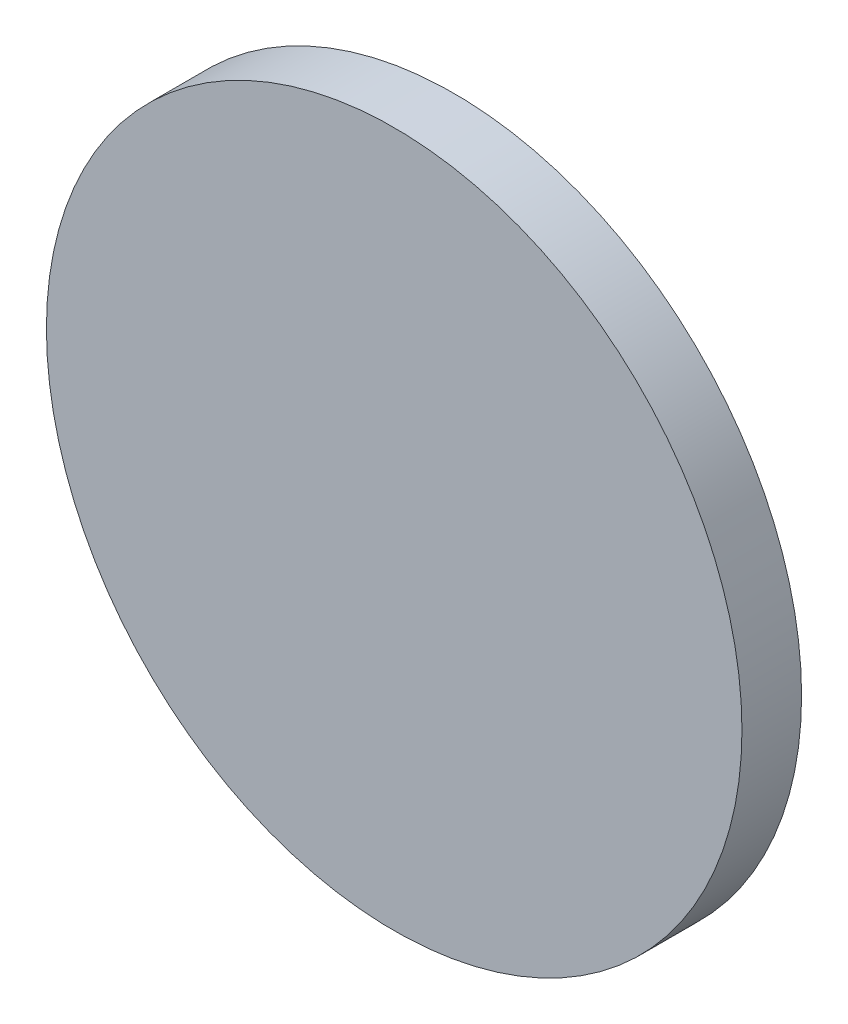
ISO-10303-21;
HEADER;
FILE_DESCRIPTION(('STEP AP214'),'2;1');
FILE_NAME('part.step','',(''),(''),'','','');
FILE_SCHEMA(('AUTOMOTIVE_DESIGN { 1 0 10303 214 1 1 1 1 }'));
ENDSEC;
DATA;
#1=APPLICATION_CONTEXT('core data for automotive mechanical design processes');
#2=APPLICATION_PROTOCOL_DEFINITION('international standard','automotive_design',2000,#1);
#3=PRODUCT_CONTEXT('',#1,'mechanical');
#4=PRODUCT('Part','Part','',(#3));
#5=PRODUCT_RELATED_PRODUCT_CATEGORY('part','',(#4));
#6=PRODUCT_DEFINITION_FORMATION('','',#4);
#7=PRODUCT_DEFINITION_CONTEXT('part definition',#1,'design');
#8=PRODUCT_DEFINITION('design','',#6,#7);
#9=PRODUCT_DEFINITION_SHAPE('','',#8);
#10=(LENGTH_UNIT() NAMED_UNIT(*) SI_UNIT(.MILLI.,.METRE.));
#11=(NAMED_UNIT(*) PLANE_ANGLE_UNIT() SI_UNIT($,.RADIAN.));
#12=(NAMED_UNIT(*) SI_UNIT($,.STERADIAN.) SOLID_ANGLE_UNIT());
#13=UNCERTAINTY_MEASURE_WITH_UNIT(LENGTH_MEASURE(1.E-05),#10,'distance_accuracy_value','');
#14=(GEOMETRIC_REPRESENTATION_CONTEXT(3) GLOBAL_UNCERTAINTY_ASSIGNED_CONTEXT((#13)) GLOBAL_UNIT_ASSIGNED_CONTEXT((#10,
#11,#12)) REPRESENTATION_CONTEXT('',''));
#15=CARTESIAN_POINT('',(0.,0.,0.));
#16=DIRECTION('',(0.,0.,1.));
#17=DIRECTION('',(1.,0.,0.));
#18=AXIS2_PLACEMENT_3D('',#15,#16,#17);
#19=CARTESIAN_POINT('',(10.752,6.394000014875,0.));
#20=DIRECTION('',(0.,0.,-1.));
#21=DIRECTION('',(-1.,0.,0.));
#22=AXIS2_PLACEMENT_3D('',#19,#20,#21);
#23=PLANE('',#22);
#24=CARTESIAN_POINT('',(10.752,6.394000014875,0.));
#25=DIRECTION('',(0.,0.,1.));
#26=DIRECTION('',(1.,0.,0.));
#27=AXIS2_PLACEMENT_3D('',#24,#25,#26);
#28=CIRCLE('',#27,0.200024667);
#29=CARTESIAN_POINT('',(10.952024667,6.394000014875,0.));
#30=VERTEX_POINT('',#29);
#31=EDGE_CURVE('E18',#30,#30,#28,.T.);
#32=ORIENTED_EDGE('',*,*,#31,.F.);
#33=EDGE_LOOP('',(#32));
#34=FACE_BOUND('',#33,.T.);
#35=ADVANCED_FACE('F15',(#34),#23,.T.);
#36=CARTESIAN_POINT('',(10.752,6.394000014875,0.));
#37=DIRECTION('',(0.,0.,1.));
#38=DIRECTION('',(1.,0.,0.));
#39=AXIS2_PLACEMENT_3D('',#36,#37,#38);
#40=CYLINDRICAL_SURFACE('',#39,0.200024667);
#41=CARTESIAN_POINT('',(10.752,6.394000014875,0.03429));
#42=DIRECTION('',(0.,0.,1.));
#43=DIRECTION('',(1.,0.,0.));
#44=AXIS2_PLACEMENT_3D('',#41,#42,#43);
#45=CIRCLE('',#44,0.200024667);
#46=CARTESIAN_POINT('',(10.952024667,6.394000014875,0.03429));
#47=VERTEX_POINT('',#46);
#48=EDGE_CURVE('E10',#47,#47,#45,.T.);
#49=ORIENTED_EDGE('',*,*,#48,.F.);
#50=EDGE_LOOP('',(#49));
#51=FACE_BOUND('',#50,.T.);
#52=ORIENTED_EDGE('',*,*,#31,.T.);
#53=EDGE_LOOP('',(#52));
#54=FACE_BOUND('',#53,.T.);
#55=ADVANCED_FACE('F27',(#51,#54),#40,.T.);
#56=CARTESIAN_POINT('',(10.752,6.394000014875,0.03429));
#57=DIRECTION('',(0.,0.,1.));
#58=DIRECTION('',(1.,0.,0.));
#59=AXIS2_PLACEMENT_3D('',#56,#57,#58);
#60=PLANE('',#59);
#61=ORIENTED_EDGE('',*,*,#48,.T.);
#62=EDGE_LOOP('',(#61));
#63=FACE_BOUND('',#62,.T.);
#64=ADVANCED_FACE('F34',(#63),#60,.T.);
#65=CLOSED_SHELL('',(#35,#55,#64));
#66=MANIFOLD_SOLID_BREP('B1',#65);
#67=ADVANCED_BREP_SHAPE_REPRESENTATION('',(#18,#66),#14);
#68=SHAPE_DEFINITION_REPRESENTATION(#9,#67);
ENDSEC;
END-ISO-10303-21;
